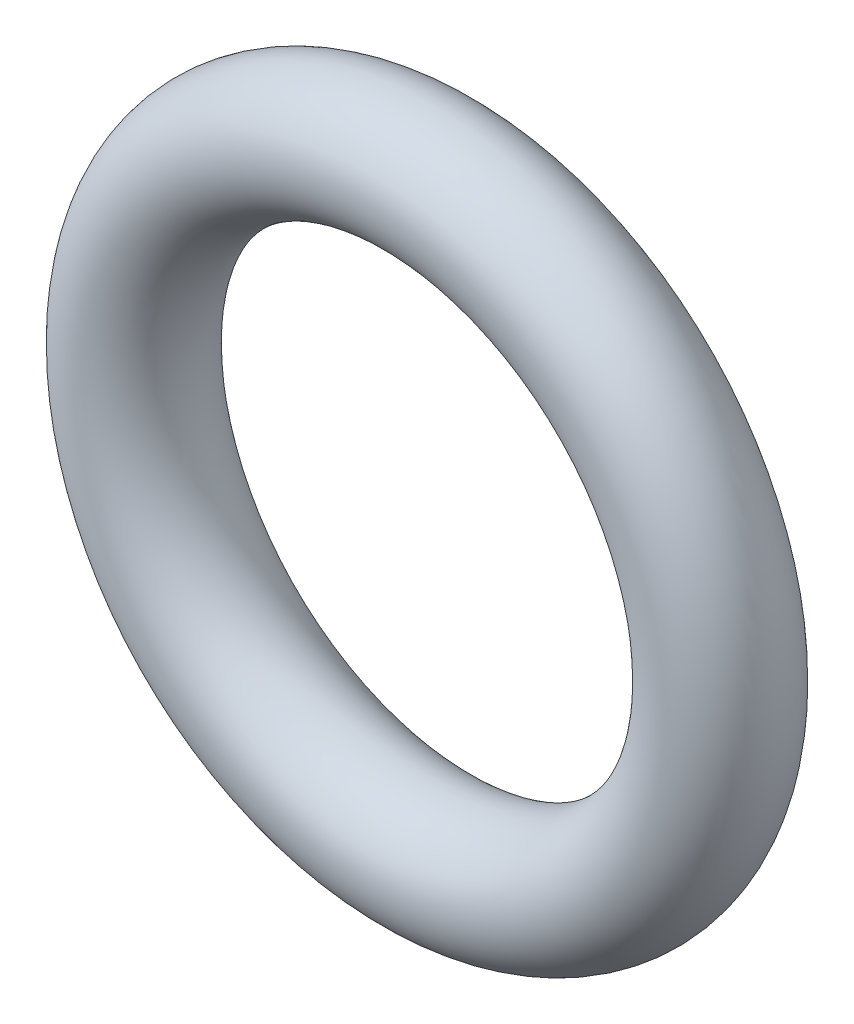
ISO-10303-21;
HEADER;
FILE_DESCRIPTION(('STEP AP214'),'2;1');
FILE_NAME('part.step','',(''),(''),'','','');
FILE_SCHEMA(('AUTOMOTIVE_DESIGN { 1 0 10303 214 1 1 1 1 }'));
ENDSEC;
DATA;
#1=APPLICATION_CONTEXT('core data for automotive mechanical design processes');
#2=APPLICATION_PROTOCOL_DEFINITION('international standard','automotive_design',2000,#1);
#3=PRODUCT_CONTEXT('',#1,'mechanical');
#4=PRODUCT('Part','Part','',(#3));
#5=PRODUCT_RELATED_PRODUCT_CATEGORY('part','',(#4));
#6=PRODUCT_DEFINITION_FORMATION('','',#4);
#7=PRODUCT_DEFINITION_CONTEXT('part definition',#1,'design');
#8=PRODUCT_DEFINITION('design','',#6,#7);
#9=PRODUCT_DEFINITION_SHAPE('','',#8);
#10=(LENGTH_UNIT() NAMED_UNIT(*) SI_UNIT(.MILLI.,.METRE.));
#11=(NAMED_UNIT(*) PLANE_ANGLE_UNIT() SI_UNIT($,.RADIAN.));
#12=(NAMED_UNIT(*) SI_UNIT($,.STERADIAN.) SOLID_ANGLE_UNIT());
#13=UNCERTAINTY_MEASURE_WITH_UNIT(LENGTH_MEASURE(1.E-05),#10,'distance_accuracy_value','');
#14=(GEOMETRIC_REPRESENTATION_CONTEXT(3) GLOBAL_UNCERTAINTY_ASSIGNED_CONTEXT((#13)) GLOBAL_UNIT_ASSIGNED_CONTEXT((#10,
#11,#12)) REPRESENTATION_CONTEXT('',''));
#15=CARTESIAN_POINT('',(0.,0.,0.));
#16=DIRECTION('',(0.,0.,1.));
#17=DIRECTION('',(1.,0.,0.));
#18=AXIS2_PLACEMENT_3D('',#15,#16,#17);
#19=CARTESIAN_POINT('',(0.,0.,0.));
#20=DIRECTION('',(0.,0.,1.));
#21=DIRECTION('',(1.,0.,0.));
#22=AXIS2_PLACEMENT_3D('',#19,#20,#21);
#23=TOROIDAL_SURFACE('',#22,3.8481,0.8128);
#24=CARTESIAN_POINT('',(4.6609,0.,0.));
#25=VERTEX_POINT('',#24);
#26=VERTEX_LOOP('',#25);
#27=FACE_BOUND('',#26,.T.);
#28=ADVANCED_FACE('F32',(#27),#23,.T.);
#29=CLOSED_SHELL('',(#28));
#30=MANIFOLD_SOLID_BREP('B2',#29);
#31=ADVANCED_BREP_SHAPE_REPRESENTATION('',(#18,#30),#14);
#32=SHAPE_DEFINITION_REPRESENTATION(#9,#31);
ENDSEC;
END-ISO-10303-21;
